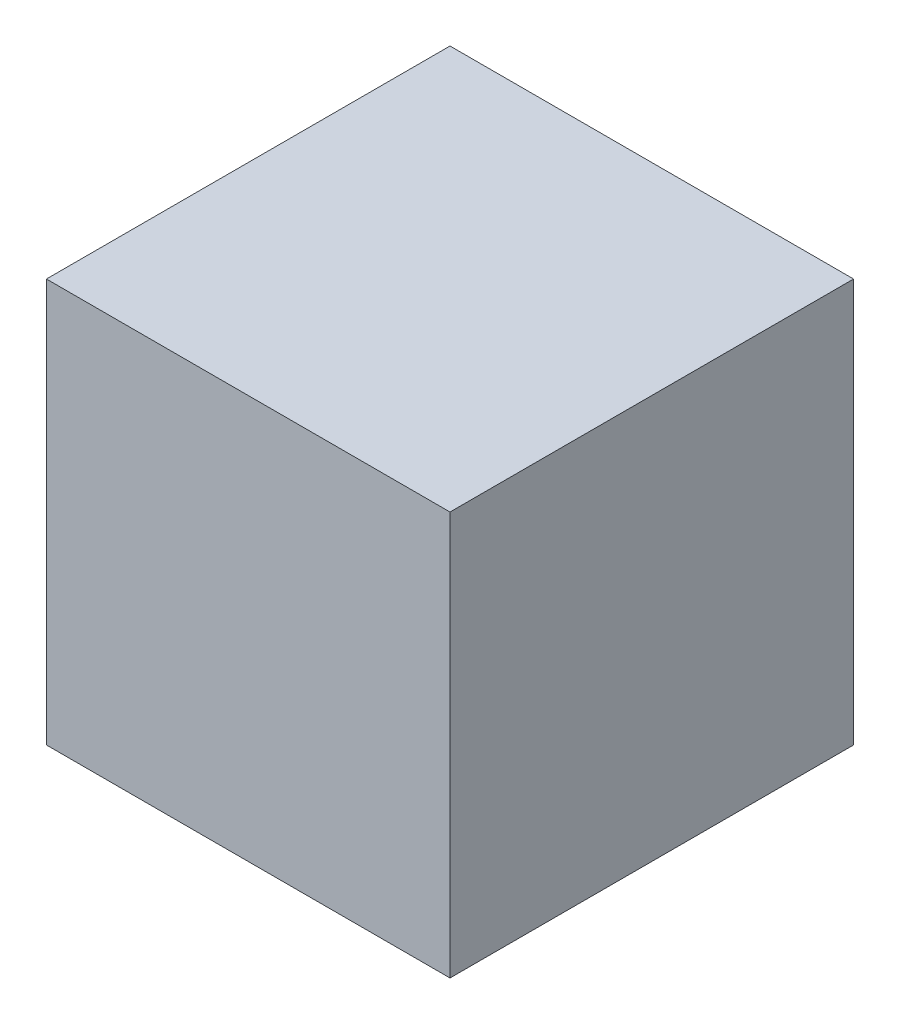
ISO-10303-21;
HEADER;
FILE_DESCRIPTION(('STEP AP214'),'2;1');
FILE_NAME('part.step','',(''),(''),'','','');
FILE_SCHEMA(('AUTOMOTIVE_DESIGN { 1 0 10303 214 1 1 1 1 }'));
ENDSEC;
DATA;
#1=APPLICATION_CONTEXT('core data for automotive mechanical design processes');
#2=APPLICATION_PROTOCOL_DEFINITION('international standard','automotive_design',2000,#1);
#3=PRODUCT_CONTEXT('',#1,'mechanical');
#4=PRODUCT('Part','Part','',(#3));
#5=PRODUCT_RELATED_PRODUCT_CATEGORY('part','',(#4));
#6=PRODUCT_DEFINITION_FORMATION('','',#4);
#7=PRODUCT_DEFINITION_CONTEXT('part definition',#1,'design');
#8=PRODUCT_DEFINITION('design','',#6,#7);
#9=PRODUCT_DEFINITION_SHAPE('','',#8);
#10=(LENGTH_UNIT() NAMED_UNIT(*) SI_UNIT(.MILLI.,.METRE.));
#11=(NAMED_UNIT(*) PLANE_ANGLE_UNIT() SI_UNIT($,.RADIAN.));
#12=(NAMED_UNIT(*) SI_UNIT($,.STERADIAN.) SOLID_ANGLE_UNIT());
#13=UNCERTAINTY_MEASURE_WITH_UNIT(LENGTH_MEASURE(1.E-05),#10,'distance_accuracy_value','');
#14=(GEOMETRIC_REPRESENTATION_CONTEXT(3) GLOBAL_UNCERTAINTY_ASSIGNED_CONTEXT((#13)) GLOBAL_UNIT_ASSIGNED_CONTEXT((#10,
#11,#12)) REPRESENTATION_CONTEXT('',''));
#15=CARTESIAN_POINT('',(0.,0.,0.));
#16=DIRECTION('',(0.,0.,1.));
#17=DIRECTION('',(1.,0.,0.));
#18=AXIS2_PLACEMENT_3D('',#15,#16,#17);
#19=CARTESIAN_POINT('',(0.,152.4,0.));
#20=DIRECTION('',(0.,1.,0.));
#21=DIRECTION('',(0.,0.,1.));
#22=AXIS2_PLACEMENT_3D('',#19,#20,#21);
#23=PLANE('',#22);
#24=DIRECTION('',(1.,0.,0.));
#25=VECTOR('',#24,1.);
#26=CARTESIAN_POINT('',(-76.2,152.4,76.2));
#27=LINE('',#26,#25);
#28=CARTESIAN_POINT('',(76.2,152.4,76.2));
#29=VERTEX_POINT('',#28);
#30=CARTESIAN_POINT('',(-76.2,152.4,76.2));
#31=VERTEX_POINT('',#30);
#32=EDGE_CURVE('E76',#29,#31,#27,.F.);
#33=ORIENTED_EDGE('',*,*,#32,.F.);
#34=DIRECTION('',(0.,0.,-1.));
#35=VECTOR('',#34,1.);
#36=CARTESIAN_POINT('',(76.2,152.4,76.2));
#37=LINE('',#36,#35);
#38=CARTESIAN_POINT('',(76.2,152.4,-76.2));
#39=VERTEX_POINT('',#38);
#40=EDGE_CURVE('E58',#39,#29,#37,.F.);
#41=ORIENTED_EDGE('',*,*,#40,.F.);
#42=DIRECTION('',(-1.,0.,0.));
#43=VECTOR('',#42,1.);
#44=CARTESIAN_POINT('',(76.2,152.4,-76.2));
#45=LINE('',#44,#43);
#46=CARTESIAN_POINT('',(-76.2,152.4,-76.2));
#47=VERTEX_POINT('',#46);
#48=EDGE_CURVE('E20',#47,#39,#45,.F.);
#49=ORIENTED_EDGE('',*,*,#48,.F.);
#50=DIRECTION('',(0.,0.,1.));
#51=VECTOR('',#50,1.);
#52=CARTESIAN_POINT('',(-76.2,152.4,-76.2));
#53=LINE('',#52,#51);
#54=EDGE_CURVE('E55',#31,#47,#53,.F.);
#55=ORIENTED_EDGE('',*,*,#54,.F.);
#56=EDGE_LOOP('',(#33,#41,#49,#55));
#57=FACE_BOUND('',#56,.T.);
#58=ADVANCED_FACE('F17',(#57),#23,.T.);
#59=CARTESIAN_POINT('',(76.2,0.,-76.2));
#60=DIRECTION('',(0.,0.,-1.));
#61=DIRECTION('',(-1.,0.,0.));
#62=AXIS2_PLACEMENT_3D('',#59,#60,#61);
#63=PLANE('',#62);
#64=DIRECTION('',(0.,1.,0.));
#65=VECTOR('',#64,1.);
#66=CARTESIAN_POINT('',(-76.2,0.,-76.2));
#67=LINE('',#66,#65);
#68=CARTESIAN_POINT('',(-76.2,0.,-76.2));
#69=VERTEX_POINT('',#68);
#70=EDGE_CURVE('E63',#47,#69,#67,.F.);
#71=ORIENTED_EDGE('',*,*,#70,.F.);
#72=ORIENTED_EDGE('',*,*,#48,.T.);
#73=DIRECTION('',(0.,1.,0.));
#74=VECTOR('',#73,1.);
#75=CARTESIAN_POINT('',(76.2,0.,-76.2));
#76=LINE('',#75,#74);
#77=CARTESIAN_POINT('',(76.2,0.,-76.2));
#78=VERTEX_POINT('',#77);
#79=EDGE_CURVE('E79',#78,#39,#76,.T.);
#80=ORIENTED_EDGE('',*,*,#79,.F.);
#81=DIRECTION('',(1.,0.,0.));
#82=VECTOR('',#81,1.);
#83=CARTESIAN_POINT('',(0.,0.,-76.2));
#84=LINE('',#83,#82);
#85=EDGE_CURVE('E73',#78,#69,#84,.F.);
#86=ORIENTED_EDGE('',*,*,#85,.T.);
#87=EDGE_LOOP('',(#71,#72,#80,#86));
#88=FACE_BOUND('',#87,.T.);
#89=ADVANCED_FACE('F72',(#88),#63,.T.);
#90=CARTESIAN_POINT('',(-76.2,0.,-76.2));
#91=DIRECTION('',(-1.,0.,0.));
#92=DIRECTION('',(0.,0.,1.));
#93=AXIS2_PLACEMENT_3D('',#90,#91,#92);
#94=PLANE('',#93);
#95=DIRECTION('',(0.,1.,0.));
#96=VECTOR('',#95,1.);
#97=CARTESIAN_POINT('',(-76.2,0.,76.2));
#98=LINE('',#97,#96);
#99=CARTESIAN_POINT('',(-76.2,0.,76.2));
#100=VERTEX_POINT('',#99);
#101=EDGE_CURVE('E69',#31,#100,#98,.F.);
#102=ORIENTED_EDGE('',*,*,#101,.F.);
#103=ORIENTED_EDGE('',*,*,#54,.T.);
#104=ORIENTED_EDGE('',*,*,#70,.T.);
#105=DIRECTION('',(0.,0.,1.));
#106=VECTOR('',#105,1.);
#107=CARTESIAN_POINT('',(-76.2,0.,0.));
#108=LINE('',#107,#106);
#109=EDGE_CURVE('E83',#69,#100,#108,.T.);
#110=ORIENTED_EDGE('',*,*,#109,.T.);
#111=EDGE_LOOP('',(#102,#103,#104,#110));
#112=FACE_BOUND('',#111,.T.);
#113=ADVANCED_FACE('F66',(#112),#94,.T.);
#114=CARTESIAN_POINT('',(-76.2,0.,76.2));
#115=DIRECTION('',(0.,0.,1.));
#116=DIRECTION('',(1.,0.,0.));
#117=AXIS2_PLACEMENT_3D('',#114,#115,#116);
#118=PLANE('',#117);
#119=DIRECTION('',(0.,1.,0.));
#120=VECTOR('',#119,1.);
#121=CARTESIAN_POINT('',(76.2,0.,76.2));
#122=LINE('',#121,#120);
#123=CARTESIAN_POINT('',(76.2,0.,76.2));
#124=VERTEX_POINT('',#123);
#125=EDGE_CURVE('E34',#29,#124,#122,.F.);
#126=ORIENTED_EDGE('',*,*,#125,.F.);
#127=ORIENTED_EDGE('',*,*,#32,.T.);
#128=ORIENTED_EDGE('',*,*,#101,.T.);
#129=DIRECTION('',(1.,0.,0.));
#130=VECTOR('',#129,1.);
#131=CARTESIAN_POINT('',(0.,0.,76.2));
#132=LINE('',#131,#130);
#133=EDGE_CURVE('E26',#100,#124,#132,.T.);
#134=ORIENTED_EDGE('',*,*,#133,.T.);
#135=EDGE_LOOP('',(#126,#127,#128,#134));
#136=FACE_BOUND('',#135,.T.);
#137=ADVANCED_FACE('F88',(#136),#118,.T.);
#138=CARTESIAN_POINT('',(76.2,0.,76.2));
#139=DIRECTION('',(1.,0.,0.));
#140=DIRECTION('',(0.,0.,-1.));
#141=AXIS2_PLACEMENT_3D('',#138,#139,#140);
#142=PLANE('',#141);
#143=ORIENTED_EDGE('',*,*,#79,.T.);
#144=ORIENTED_EDGE('',*,*,#40,.T.);
#145=ORIENTED_EDGE('',*,*,#125,.T.);
#146=DIRECTION('',(0.,0.,1.));
#147=VECTOR('',#146,1.);
#148=CARTESIAN_POINT('',(76.2,0.,0.));
#149=LINE('',#148,#147);
#150=EDGE_CURVE('E11',#124,#78,#149,.F.);
#151=ORIENTED_EDGE('',*,*,#150,.T.);
#152=EDGE_LOOP('',(#143,#144,#145,#151));
#153=FACE_BOUND('',#152,.T.);
#154=ADVANCED_FACE('F91',(#153),#142,.T.);
#155=CARTESIAN_POINT('',(0.,0.,0.));
#156=DIRECTION('',(0.,1.,0.));
#157=DIRECTION('',(0.,0.,1.));
#158=AXIS2_PLACEMENT_3D('',#155,#156,#157);
#159=PLANE('',#158);
#160=ORIENTED_EDGE('',*,*,#133,.F.);
#161=ORIENTED_EDGE('',*,*,#109,.F.);
#162=ORIENTED_EDGE('',*,*,#85,.F.);
#163=ORIENTED_EDGE('',*,*,#150,.F.);
#164=EDGE_LOOP('',(#160,#161,#162,#163));
#165=FACE_BOUND('',#164,.T.);
#166=ADVANCED_FACE('F90',(#165),#159,.F.);
#167=CLOSED_SHELL('',(#58,#89,#113,#137,#154,#166));
#168=MANIFOLD_SOLID_BREP('B1',#167);
#169=ADVANCED_BREP_SHAPE_REPRESENTATION('',(#18,#168),#14);
#170=SHAPE_DEFINITION_REPRESENTATION(#9,#169);
ENDSEC;
END-ISO-10303-21;
